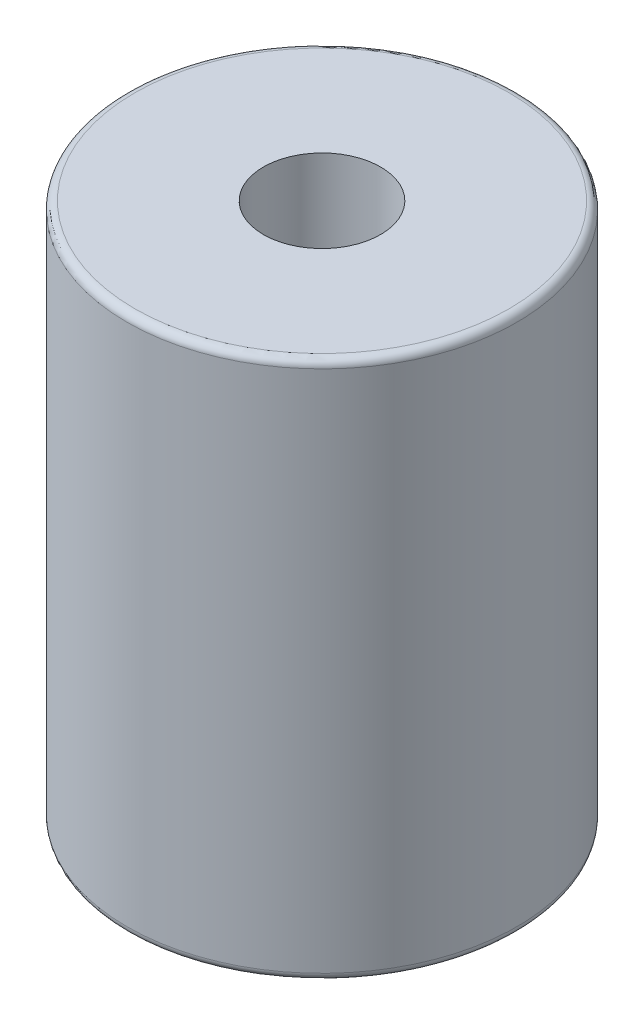
ISO-10303-21;
HEADER;
FILE_DESCRIPTION(('STEP AP214'),'2;1');
FILE_NAME('part.step','',(''),(''),'','','');
FILE_SCHEMA(('AUTOMOTIVE_DESIGN { 1 0 10303 214 1 1 1 1 }'));
ENDSEC;
DATA;
#1=APPLICATION_CONTEXT('core data for automotive mechanical design processes');
#2=APPLICATION_PROTOCOL_DEFINITION('international standard','automotive_design',2000,#1);
#3=PRODUCT_CONTEXT('',#1,'mechanical');
#4=PRODUCT('Part','Part','',(#3));
#5=PRODUCT_RELATED_PRODUCT_CATEGORY('part','',(#4));
#6=PRODUCT_DEFINITION_FORMATION('','',#4);
#7=PRODUCT_DEFINITION_CONTEXT('part definition',#1,'design');
#8=PRODUCT_DEFINITION('design','',#6,#7);
#9=PRODUCT_DEFINITION_SHAPE('','',#8);
#10=(LENGTH_UNIT() NAMED_UNIT(*) SI_UNIT(.MILLI.,.METRE.));
#11=(NAMED_UNIT(*) PLANE_ANGLE_UNIT() SI_UNIT($,.RADIAN.));
#12=(NAMED_UNIT(*) SI_UNIT($,.STERADIAN.) SOLID_ANGLE_UNIT());
#13=UNCERTAINTY_MEASURE_WITH_UNIT(LENGTH_MEASURE(1.E-05),#10,'distance_accuracy_value','');
#14=(GEOMETRIC_REPRESENTATION_CONTEXT(3) GLOBAL_UNCERTAINTY_ASSIGNED_CONTEXT((#13)) GLOBAL_UNIT_ASSIGNED_CONTEXT((#10,
#11,#12)) REPRESENTATION_CONTEXT('',''));
#15=CARTESIAN_POINT('',(0.,0.,0.));
#16=DIRECTION('',(0.,0.,1.));
#17=DIRECTION('',(1.,0.,0.));
#18=AXIS2_PLACEMENT_3D('',#15,#16,#17);
#19=CARTESIAN_POINT('',(0.,6.9,0.));
#20=DIRECTION('',(0.,-1.,0.));
#21=DIRECTION('',(0.,0.,-1.));
#22=AXIS2_PLACEMENT_3D('',#19,#20,#21);
#23=CYLINDRICAL_SURFACE('',#22,2.495);
#24=CARTESIAN_POINT('',(0.,0.1,0.));
#25=DIRECTION('',(0.,1.,0.));
#26=DIRECTION('',(0.,0.,1.));
#27=AXIS2_PLACEMENT_3D('',#24,#25,#26);
#28=CIRCLE('',#27,2.495);
#29=CARTESIAN_POINT('',(0.,0.1,2.495));
#30=VERTEX_POINT('',#29);
#31=EDGE_CURVE('E42',#30,#30,#28,.T.);
#32=ORIENTED_EDGE('',*,*,#31,.T.);
#33=EDGE_LOOP('',(#32));
#34=FACE_BOUND('',#33,.T.);
#35=CARTESIAN_POINT('',(0.,6.8,0.));
#36=DIRECTION('',(0.,1.,0.));
#37=DIRECTION('',(0.,0.,1.));
#38=AXIS2_PLACEMENT_3D('',#35,#36,#37);
#39=CIRCLE('',#38,2.495);
#40=CARTESIAN_POINT('',(0.,6.8,2.495));
#41=VERTEX_POINT('',#40);
#42=EDGE_CURVE('E46',#41,#41,#39,.F.);
#43=ORIENTED_EDGE('',*,*,#42,.T.);
#44=EDGE_LOOP('',(#43));
#45=FACE_BOUND('',#44,.T.);
#46=ADVANCED_FACE('F31',(#34,#45),#23,.T.);
#47=CARTESIAN_POINT('',(0.,6.9,0.));
#48=DIRECTION('',(0.,1.,0.));
#49=DIRECTION('',(0.,0.,1.));
#50=AXIS2_PLACEMENT_3D('',#47,#48,#49);
#51=PLANE('',#50);
#52=CARTESIAN_POINT('',(0.,6.9,0.));
#53=DIRECTION('',(0.,1.,0.));
#54=DIRECTION('',(0.,0.,1.));
#55=AXIS2_PLACEMENT_3D('',#52,#53,#54);
#56=CIRCLE('',#55,0.75);
#57=CARTESIAN_POINT('',(0.,6.9,0.75));
#58=VERTEX_POINT('',#57);
#59=EDGE_CURVE('E52',#58,#58,#56,.T.);
#60=ORIENTED_EDGE('',*,*,#59,.F.);
#61=EDGE_LOOP('',(#60));
#62=FACE_BOUND('',#61,.T.);
#63=CARTESIAN_POINT('',(0.,6.9,0.));
#64=DIRECTION('',(0.,1.,0.));
#65=DIRECTION('',(0.,0.,1.));
#66=AXIS2_PLACEMENT_3D('',#63,#64,#65);
#67=CIRCLE('',#66,2.395);
#68=CARTESIAN_POINT('',(0.,6.9,2.395));
#69=VERTEX_POINT('',#68);
#70=EDGE_CURVE('E10',#69,#69,#67,.T.);
#71=ORIENTED_EDGE('',*,*,#70,.T.);
#72=EDGE_LOOP('',(#71));
#73=FACE_BOUND('',#72,.T.);
#74=ADVANCED_FACE('F66',(#62,#73),#51,.T.);
#75=CARTESIAN_POINT('',(0.,0.,0.));
#76=DIRECTION('',(0.,1.,0.));
#77=DIRECTION('',(0.,0.,1.));
#78=AXIS2_PLACEMENT_3D('',#75,#76,#77);
#79=PLANE('',#78);
#80=CARTESIAN_POINT('',(0.,0.,0.));
#81=DIRECTION('',(0.,1.,0.));
#82=DIRECTION('',(0.,0.,1.));
#83=AXIS2_PLACEMENT_3D('',#80,#81,#82);
#84=CIRCLE('',#83,2.395);
#85=CARTESIAN_POINT('',(0.,0.,2.395));
#86=VERTEX_POINT('',#85);
#87=EDGE_CURVE('E38',#86,#86,#84,.F.);
#88=ORIENTED_EDGE('',*,*,#87,.T.);
#89=EDGE_LOOP('',(#88));
#90=FACE_BOUND('',#89,.T.);
#91=ADVANCED_FACE('F68',(#90),#79,.F.);
#92=CARTESIAN_POINT('',(0.,0.1,0.));
#93=DIRECTION('',(0.,1.,0.));
#94=DIRECTION('',(0.,0.,1.));
#95=AXIS2_PLACEMENT_3D('',#92,#93,#94);
#96=TOROIDAL_SURFACE('',#95,2.395,0.1);
#97=ORIENTED_EDGE('',*,*,#87,.F.);
#98=EDGE_LOOP('',(#97));
#99=FACE_BOUND('',#98,.T.);
#100=ORIENTED_EDGE('',*,*,#31,.F.);
#101=EDGE_LOOP('',(#100));
#102=FACE_BOUND('',#101,.T.);
#103=ADVANCED_FACE('F75',(#99,#102),#96,.T.);
#104=CARTESIAN_POINT('',(0.,6.8,0.));
#105=DIRECTION('',(0.,1.,0.));
#106=DIRECTION('',(0.,0.,1.));
#107=AXIS2_PLACEMENT_3D('',#104,#105,#106);
#108=TOROIDAL_SURFACE('',#107,2.395,0.1);
#109=ORIENTED_EDGE('',*,*,#42,.F.);
#110=EDGE_LOOP('',(#109));
#111=FACE_BOUND('',#110,.T.);
#112=ORIENTED_EDGE('',*,*,#70,.F.);
#113=EDGE_LOOP('',(#112));
#114=FACE_BOUND('',#113,.T.);
#115=ADVANCED_FACE('F33',(#111,#114),#108,.T.);
#116=CARTESIAN_POINT('',(0.,3.9,0.));
#117=DIRECTION('',(0.,1.,0.));
#118=DIRECTION('',(0.,0.,1.));
#119=AXIS2_PLACEMENT_3D('',#116,#117,#118);
#120=CYLINDRICAL_SURFACE('',#119,0.75);
#121=CARTESIAN_POINT('',(0.,3.9,0.));
#122=DIRECTION('',(0.,1.,0.));
#123=DIRECTION('',(0.,0.,1.));
#124=AXIS2_PLACEMENT_3D('',#121,#122,#123);
#125=CIRCLE('',#124,0.75);
#126=CARTESIAN_POINT('',(0.,3.9,0.75));
#127=VERTEX_POINT('',#126);
#128=EDGE_CURVE('E51',#127,#127,#125,.T.);
#129=ORIENTED_EDGE('',*,*,#128,.F.);
#130=EDGE_LOOP('',(#129));
#131=FACE_BOUND('',#130,.T.);
#132=ORIENTED_EDGE('',*,*,#59,.T.);
#133=EDGE_LOOP('',(#132));
#134=FACE_BOUND('',#133,.T.);
#135=ADVANCED_FACE('F60',(#131,#134),#120,.F.);
#136=CARTESIAN_POINT('',(0.,3.9,0.));
#137=DIRECTION('',(0.,1.,0.));
#138=DIRECTION('',(0.,0.,1.));
#139=AXIS2_PLACEMENT_3D('',#136,#137,#138);
#140=PLANE('',#139);
#141=ORIENTED_EDGE('',*,*,#128,.T.);
#142=EDGE_LOOP('',(#141));
#143=FACE_BOUND('',#142,.T.);
#144=ADVANCED_FACE('F58',(#143),#140,.T.);
#145=CLOSED_SHELL('',(#46,#74,#91,#103,#115,#135,#144));
#146=MANIFOLD_SOLID_BREP('B2',#145);
#147=ADVANCED_BREP_SHAPE_REPRESENTATION('',(#18,#146),#14);
#148=SHAPE_DEFINITION_REPRESENTATION(#9,#147);
ENDSEC;
END-ISO-10303-21;
